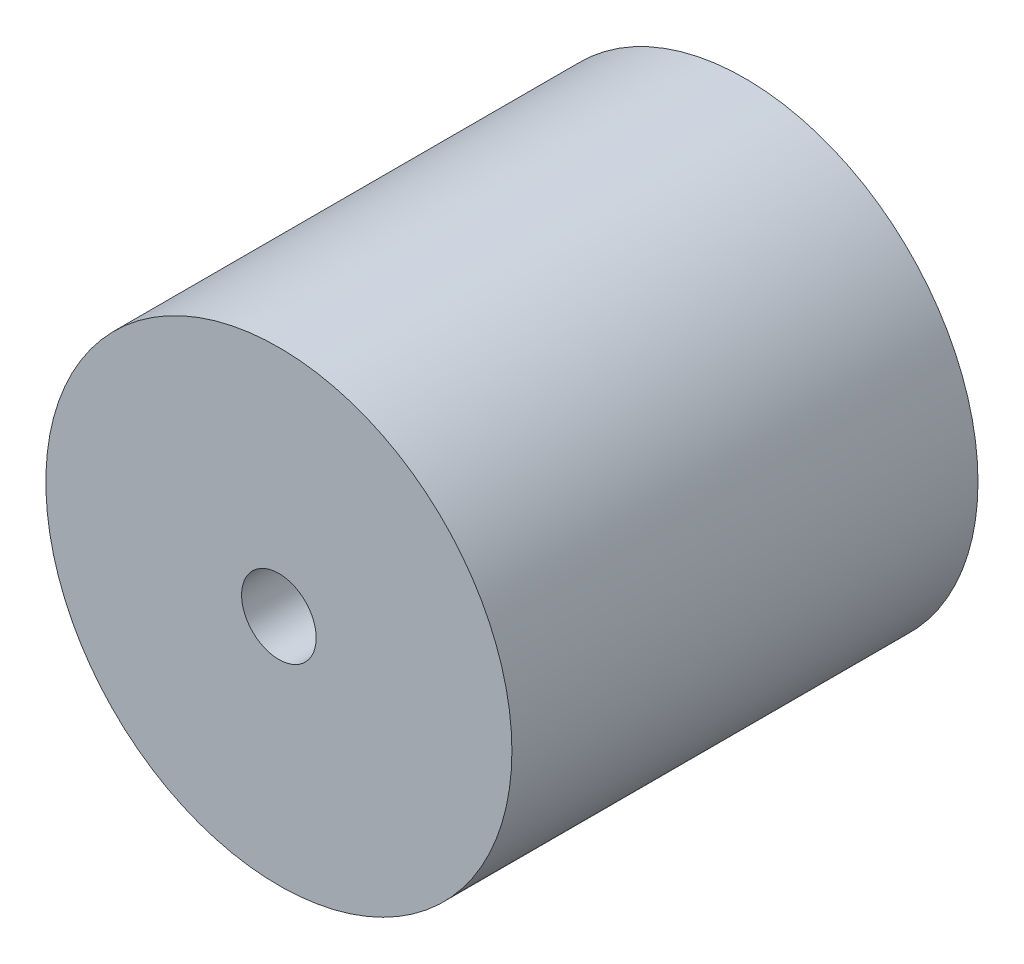
ISO-10303-21;
HEADER;
FILE_DESCRIPTION(('STEP AP214'),'2;1');
FILE_NAME('part.step','',(''),(''),'','','');
FILE_SCHEMA(('AUTOMOTIVE_DESIGN { 1 0 10303 214 1 1 1 1 }'));
ENDSEC;
DATA;
#1=APPLICATION_CONTEXT('core data for automotive mechanical design processes');
#2=APPLICATION_PROTOCOL_DEFINITION('international standard','automotive_design',2000,#1);
#3=PRODUCT_CONTEXT('',#1,'mechanical');
#4=PRODUCT('Part','Part','',(#3));
#5=PRODUCT_RELATED_PRODUCT_CATEGORY('part','',(#4));
#6=PRODUCT_DEFINITION_FORMATION('','',#4);
#7=PRODUCT_DEFINITION_CONTEXT('part definition',#1,'design');
#8=PRODUCT_DEFINITION('design','',#6,#7);
#9=PRODUCT_DEFINITION_SHAPE('','',#8);
#10=(LENGTH_UNIT() NAMED_UNIT(*) SI_UNIT(.MILLI.,.METRE.));
#11=(NAMED_UNIT(*) PLANE_ANGLE_UNIT() SI_UNIT($,.RADIAN.));
#12=(NAMED_UNIT(*) SI_UNIT($,.STERADIAN.) SOLID_ANGLE_UNIT());
#13=UNCERTAINTY_MEASURE_WITH_UNIT(LENGTH_MEASURE(1.E-05),#10,'distance_accuracy_value','');
#14=(GEOMETRIC_REPRESENTATION_CONTEXT(3) GLOBAL_UNCERTAINTY_ASSIGNED_CONTEXT((#13)) GLOBAL_UNIT_ASSIGNED_CONTEXT((#10,
#11,#12)) REPRESENTATION_CONTEXT('',''));
#15=CARTESIAN_POINT('',(0.,0.,0.));
#16=DIRECTION('',(0.,0.,1.));
#17=DIRECTION('',(1.,0.,0.));
#18=AXIS2_PLACEMENT_3D('',#15,#16,#17);
#19=CARTESIAN_POINT('',(0.,0.,25.));
#20=DIRECTION('',(0.,0.,1.));
#21=DIRECTION('',(1.,0.,0.));
#22=AXIS2_PLACEMENT_3D('',#19,#20,#21);
#23=PLANE('',#22);
#24=CARTESIAN_POINT('',(0.,0.,25.));
#25=DIRECTION('',(0.,0.,1.));
#26=DIRECTION('',(1.,0.,0.));
#27=AXIS2_PLACEMENT_3D('',#24,#25,#26);
#28=CIRCLE('',#27,12.5);
#29=CARTESIAN_POINT('',(12.5,0.,25.));
#30=VERTEX_POINT('',#29);
#31=EDGE_CURVE('E10',#30,#30,#28,.T.);
#32=ORIENTED_EDGE('',*,*,#31,.T.);
#33=EDGE_LOOP('',(#32));
#34=FACE_BOUND('',#33,.T.);
#35=CARTESIAN_POINT('',(0.,0.,25.));
#36=DIRECTION('',(0.,0.,1.));
#37=DIRECTION('',(1.,0.,0.));
#38=AXIS2_PLACEMENT_3D('',#35,#36,#37);
#39=CIRCLE('',#38,2.);
#40=CARTESIAN_POINT('',(2.,0.,25.));
#41=VERTEX_POINT('',#40);
#42=EDGE_CURVE('E54',#41,#41,#39,.T.);
#43=ORIENTED_EDGE('',*,*,#42,.F.);
#44=EDGE_LOOP('',(#43));
#45=FACE_BOUND('',#44,.T.);
#46=ADVANCED_FACE('F41',(#34,#45),#23,.T.);
#47=CARTESIAN_POINT('',(0.,0.,0.));
#48=DIRECTION('',(0.,0.,1.));
#49=DIRECTION('',(1.,0.,0.));
#50=AXIS2_PLACEMENT_3D('',#47,#48,#49);
#51=PLANE('',#50);
#52=CARTESIAN_POINT('',(0.,0.,0.));
#53=DIRECTION('',(0.,0.,1.));
#54=DIRECTION('',(1.,0.,0.));
#55=AXIS2_PLACEMENT_3D('',#52,#53,#54);
#56=CIRCLE('',#55,12.5);
#57=CARTESIAN_POINT('',(12.5,0.,0.));
#58=VERTEX_POINT('',#57);
#59=EDGE_CURVE('E45',#58,#58,#56,.T.);
#60=ORIENTED_EDGE('',*,*,#59,.F.);
#61=EDGE_LOOP('',(#60));
#62=FACE_BOUND('',#61,.T.);
#63=CARTESIAN_POINT('',(0.,0.,0.));
#64=DIRECTION('',(0.,0.,1.));
#65=DIRECTION('',(1.,0.,0.));
#66=AXIS2_PLACEMENT_3D('',#63,#64,#65);
#67=CIRCLE('',#66,2.);
#68=CARTESIAN_POINT('',(2.,0.,0.));
#69=VERTEX_POINT('',#68);
#70=EDGE_CURVE('E56',#69,#69,#67,.T.);
#71=ORIENTED_EDGE('',*,*,#70,.T.);
#72=EDGE_LOOP('',(#71));
#73=FACE_BOUND('',#72,.T.);
#74=ADVANCED_FACE('F68',(#62,#73),#51,.F.);
#75=CARTESIAN_POINT('',(0.,0.,25.));
#76=DIRECTION('',(0.,0.,-1.));
#77=DIRECTION('',(-1.,0.,0.));
#78=AXIS2_PLACEMENT_3D('',#75,#76,#77);
#79=CYLINDRICAL_SURFACE('',#78,12.5);
#80=ORIENTED_EDGE('',*,*,#31,.F.);
#81=EDGE_LOOP('',(#80));
#82=FACE_BOUND('',#81,.T.);
#83=ORIENTED_EDGE('',*,*,#59,.T.);
#84=EDGE_LOOP('',(#83));
#85=FACE_BOUND('',#84,.T.);
#86=ADVANCED_FACE('F43',(#82,#85),#79,.T.);
#87=CARTESIAN_POINT('',(0.,0.,25.));
#88=DIRECTION('',(0.,0.,-1.));
#89=DIRECTION('',(-1.,0.,0.));
#90=AXIS2_PLACEMENT_3D('',#87,#88,#89);
#91=CYLINDRICAL_SURFACE('',#90,2.);
#92=ORIENTED_EDGE('',*,*,#42,.T.);
#93=EDGE_LOOP('',(#92));
#94=FACE_BOUND('',#93,.T.);
#95=ORIENTED_EDGE('',*,*,#70,.F.);
#96=EDGE_LOOP('',(#95));
#97=FACE_BOUND('',#96,.T.);
#98=ADVANCED_FACE('F64',(#94,#97),#91,.F.);
#99=CLOSED_SHELL('',(#46,#74,#86,#98));
#100=MANIFOLD_SOLID_BREP('B2',#99);
#101=ADVANCED_BREP_SHAPE_REPRESENTATION('',(#18,#100),#14);
#102=SHAPE_DEFINITION_REPRESENTATION(#9,#101);
ENDSEC;
END-ISO-10303-21;
